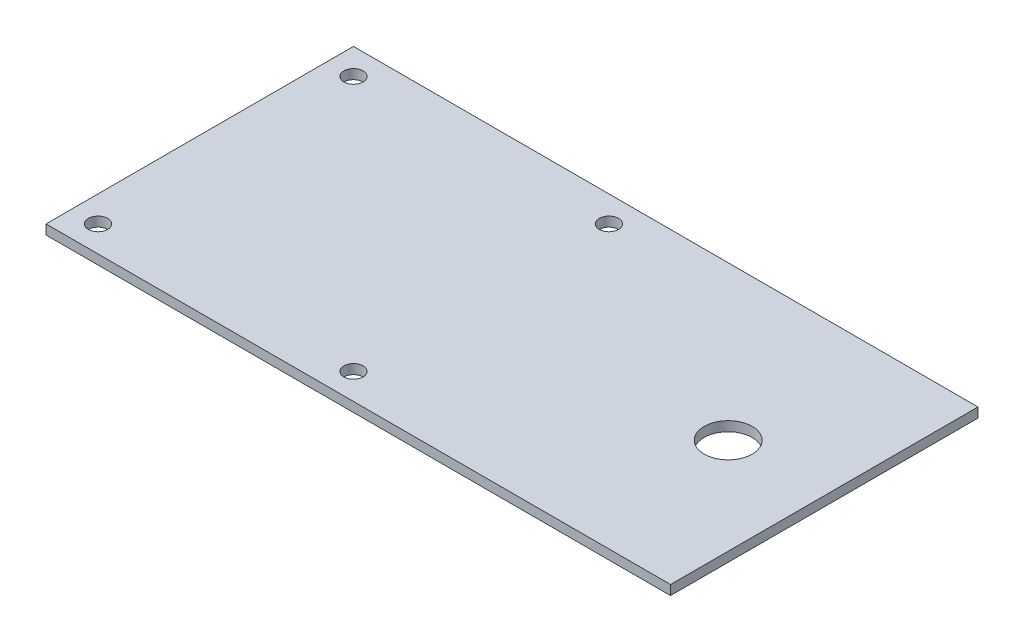
ISO-10303-21;
HEADER;
FILE_DESCRIPTION(('STEP AP214'),'2;1');
FILE_NAME('part.step','',(''),(''),'','','');
FILE_SCHEMA(('AUTOMOTIVE_DESIGN { 1 0 10303 214 1 1 1 1 }'));
ENDSEC;
DATA;
#1=APPLICATION_CONTEXT('core data for automotive mechanical design processes');
#2=APPLICATION_PROTOCOL_DEFINITION('international standard','automotive_design',2000,#1);
#3=PRODUCT_CONTEXT('',#1,'mechanical');
#4=PRODUCT('Part','Part','',(#3));
#5=PRODUCT_RELATED_PRODUCT_CATEGORY('part','',(#4));
#6=PRODUCT_DEFINITION_FORMATION('','',#4);
#7=PRODUCT_DEFINITION_CONTEXT('part definition',#1,'design');
#8=PRODUCT_DEFINITION('design','',#6,#7);
#9=PRODUCT_DEFINITION_SHAPE('','',#8);
#10=(LENGTH_UNIT() NAMED_UNIT(*) SI_UNIT(.MILLI.,.METRE.));
#11=(NAMED_UNIT(*) PLANE_ANGLE_UNIT() SI_UNIT($,.RADIAN.));
#12=(NAMED_UNIT(*) SI_UNIT($,.STERADIAN.) SOLID_ANGLE_UNIT());
#13=UNCERTAINTY_MEASURE_WITH_UNIT(LENGTH_MEASURE(1.E-05),#10,'distance_accuracy_value','');
#14=(GEOMETRIC_REPRESENTATION_CONTEXT(3) GLOBAL_UNCERTAINTY_ASSIGNED_CONTEXT((#13)) GLOBAL_UNIT_ASSIGNED_CONTEXT((#10,
#11,#12)) REPRESENTATION_CONTEXT('',''));
#15=CARTESIAN_POINT('',(0.,0.,0.));
#16=DIRECTION('',(0.,0.,1.));
#17=DIRECTION('',(1.,0.,0.));
#18=AXIS2_PLACEMENT_3D('',#15,#16,#17);
#19=CARTESIAN_POINT('',(0.,10.,0.));
#20=DIRECTION('',(0.,-1.,0.));
#21=DIRECTION('',(0.,0.,-1.));
#22=AXIS2_PLACEMENT_3D('',#19,#20,#21);
#23=PLANE('',#22);
#24=DIRECTION('',(0.,0.,-1.));
#25=VECTOR('',#24,1.);
#26=CARTESIAN_POINT('',(350.,10.,160.));
#27=LINE('',#26,#25);
#28=CARTESIAN_POINT('',(350.,10.,160.));
#29=VERTEX_POINT('',#28);
#30=CARTESIAN_POINT('',(350.,10.,-160.));
#31=VERTEX_POINT('',#30);
#32=EDGE_CURVE('E86',#29,#31,#27,.T.);
#33=ORIENTED_EDGE('',*,*,#32,.T.);
#34=DIRECTION('',(-1.,0.,0.));
#35=VECTOR('',#34,1.);
#36=CARTESIAN_POINT('',(-300.,10.,-160.));
#37=LINE('',#36,#35);
#38=CARTESIAN_POINT('',(-300.,10.,-160.));
#39=VERTEX_POINT('',#38);
#40=EDGE_CURVE('E81',#31,#39,#37,.T.);
#41=ORIENTED_EDGE('',*,*,#40,.T.);
#42=DIRECTION('',(0.,0.,1.));
#43=VECTOR('',#42,1.);
#44=CARTESIAN_POINT('',(-300.,10.,160.));
#45=LINE('',#44,#43);
#46=CARTESIAN_POINT('',(-300.,10.,160.));
#47=VERTEX_POINT('',#46);
#48=EDGE_CURVE('E84',#39,#47,#45,.T.);
#49=ORIENTED_EDGE('',*,*,#48,.T.);
#50=DIRECTION('',(1.,0.,0.));
#51=VECTOR('',#50,1.);
#52=CARTESIAN_POINT('',(-300.,10.,160.));
#53=LINE('',#52,#51);
#54=EDGE_CURVE('E51',#47,#29,#53,.T.);
#55=ORIENTED_EDGE('',*,*,#54,.T.);
#56=EDGE_LOOP('',(#33,#41,#49,#55));
#57=FACE_BOUND('',#56,.T.);
#58=CARTESIAN_POINT('',(-272.936074863071,10.,-132.936074863071));
#59=DIRECTION('',(0.,1.,0.));
#60=DIRECTION('',(0.,0.,1.));
#61=AXIS2_PLACEMENT_3D('',#58,#59,#60);
#62=CIRCLE('',#61,10.);
#63=CARTESIAN_POINT('',(-272.936074863071,10.,-122.936074863071));
#64=VERTEX_POINT('',#63);
#65=EDGE_CURVE('E101',#64,#64,#62,.T.);
#66=ORIENTED_EDGE('',*,*,#65,.F.);
#67=EDGE_LOOP('',(#66));
#68=FACE_BOUND('',#67,.T.);
#69=CARTESIAN_POINT('',(250.,10.,0.));
#70=DIRECTION('',(0.,1.,0.));
#71=DIRECTION('',(0.,0.,1.));
#72=AXIS2_PLACEMENT_3D('',#69,#70,#71);
#73=CIRCLE('',#72,25.);
#74=CARTESIAN_POINT('',(250.,10.,25.));
#75=VERTEX_POINT('',#74);
#76=EDGE_CURVE('E116',#75,#75,#73,.T.);
#77=ORIENTED_EDGE('',*,*,#76,.F.);
#78=EDGE_LOOP('',(#77));
#79=FACE_BOUND('',#78,.T.);
#80=CARTESIAN_POINT('',(-7.06392513692855,10.,-132.936074863074));
#81=DIRECTION('',(0.,1.,0.));
#82=DIRECTION('',(0.,0.,1.));
#83=AXIS2_PLACEMENT_3D('',#80,#81,#82);
#84=CIRCLE('',#83,10.0000000000001);
#85=CARTESIAN_POINT('',(-7.06392513692855,10.,-122.936074863074));
#86=VERTEX_POINT('',#85);
#87=EDGE_CURVE('E122',#86,#86,#84,.T.);
#88=ORIENTED_EDGE('',*,*,#87,.F.);
#89=EDGE_LOOP('',(#88));
#90=FACE_BOUND('',#89,.T.);
#91=CARTESIAN_POINT('',(-7.06392513692627,10.,132.936074863068));
#92=DIRECTION('',(0.,1.,0.));
#93=DIRECTION('',(0.,0.,1.));
#94=AXIS2_PLACEMENT_3D('',#91,#92,#93);
#95=CIRCLE('',#94,10.);
#96=CARTESIAN_POINT('',(-7.06392513692627,10.,142.936074863068));
#97=VERTEX_POINT('',#96);
#98=EDGE_CURVE('E128',#97,#97,#95,.T.);
#99=ORIENTED_EDGE('',*,*,#98,.F.);
#100=EDGE_LOOP('',(#99));
#101=FACE_BOUND('',#100,.T.);
#102=CARTESIAN_POINT('',(-272.936074863069,10.,132.93607486307));
#103=DIRECTION('',(0.,1.,0.));
#104=DIRECTION('',(0.,0.,1.));
#105=AXIS2_PLACEMENT_3D('',#102,#103,#104);
#106=CIRCLE('',#105,10.0000000000001);
#107=CARTESIAN_POINT('',(-272.936074863069,10.,142.93607486307));
#108=VERTEX_POINT('',#107);
#109=EDGE_CURVE('E134',#108,#108,#106,.T.);
#110=ORIENTED_EDGE('',*,*,#109,.F.);
#111=EDGE_LOOP('',(#110));
#112=FACE_BOUND('',#111,.T.);
#113=ADVANCED_FACE('F34',(#57,#68,#79,#90,#101,#112),#23,.F.);
#114=CARTESIAN_POINT('',(0.,0.,0.));
#115=DIRECTION('',(0.,-1.,0.));
#116=DIRECTION('',(0.,0.,-1.));
#117=AXIS2_PLACEMENT_3D('',#114,#115,#116);
#118=PLANE('',#117);
#119=CARTESIAN_POINT('',(-7.06392513692627,0.,132.936074863068));
#120=DIRECTION('',(0.,1.,0.));
#121=DIRECTION('',(0.,0.,1.));
#122=AXIS2_PLACEMENT_3D('',#119,#120,#121);
#123=CIRCLE('',#122,10.);
#124=CARTESIAN_POINT('',(-7.06392513692627,0.,142.936074863068));
#125=VERTEX_POINT('',#124);
#126=EDGE_CURVE('E131',#125,#125,#123,.T.);
#127=ORIENTED_EDGE('',*,*,#126,.T.);
#128=EDGE_LOOP('',(#127));
#129=FACE_BOUND('',#128,.T.);
#130=CARTESIAN_POINT('',(250.,0.,0.));
#131=DIRECTION('',(0.,1.,0.));
#132=DIRECTION('',(0.,0.,1.));
#133=AXIS2_PLACEMENT_3D('',#130,#131,#132);
#134=CIRCLE('',#133,25.);
#135=CARTESIAN_POINT('',(250.,0.,25.));
#136=VERTEX_POINT('',#135);
#137=EDGE_CURVE('E119',#136,#136,#134,.T.);
#138=ORIENTED_EDGE('',*,*,#137,.T.);
#139=EDGE_LOOP('',(#138));
#140=FACE_BOUND('',#139,.T.);
#141=DIRECTION('',(0.,0.,-1.));
#142=VECTOR('',#141,1.);
#143=CARTESIAN_POINT('',(350.,0.,160.));
#144=LINE('',#143,#142);
#145=CARTESIAN_POINT('',(350.,0.,160.));
#146=VERTEX_POINT('',#145);
#147=CARTESIAN_POINT('',(350.,0.,-160.));
#148=VERTEX_POINT('',#147);
#149=EDGE_CURVE('E98',#146,#148,#144,.T.);
#150=ORIENTED_EDGE('',*,*,#149,.F.);
#151=DIRECTION('',(1.,0.,0.));
#152=VECTOR('',#151,1.);
#153=CARTESIAN_POINT('',(-300.,0.,160.));
#154=LINE('',#153,#152);
#155=CARTESIAN_POINT('',(-300.,0.,160.));
#156=VERTEX_POINT('',#155);
#157=EDGE_CURVE('E74',#156,#146,#154,.T.);
#158=ORIENTED_EDGE('',*,*,#157,.F.);
#159=DIRECTION('',(0.,0.,1.));
#160=VECTOR('',#159,1.);
#161=CARTESIAN_POINT('',(-300.,0.,160.));
#162=LINE('',#161,#160);
#163=CARTESIAN_POINT('',(-300.,0.,-160.));
#164=VERTEX_POINT('',#163);
#165=EDGE_CURVE('E68',#164,#156,#162,.T.);
#166=ORIENTED_EDGE('',*,*,#165,.F.);
#167=DIRECTION('',(-1.,0.,0.));
#168=VECTOR('',#167,1.);
#169=CARTESIAN_POINT('',(-300.,0.,-160.));
#170=LINE('',#169,#168);
#171=EDGE_CURVE('E90',#148,#164,#170,.T.);
#172=ORIENTED_EDGE('',*,*,#171,.F.);
#173=EDGE_LOOP('',(#150,#158,#166,#172));
#174=FACE_BOUND('',#173,.T.);
#175=CARTESIAN_POINT('',(-272.936074863071,0.,-132.936074863071));
#176=DIRECTION('',(0.,1.,0.));
#177=DIRECTION('',(0.,0.,1.));
#178=AXIS2_PLACEMENT_3D('',#175,#176,#177);
#179=CIRCLE('',#178,10.);
#180=CARTESIAN_POINT('',(-272.936074863071,0.,-122.936074863071));
#181=VERTEX_POINT('',#180);
#182=EDGE_CURVE('E113',#181,#181,#179,.T.);
#183=ORIENTED_EDGE('',*,*,#182,.T.);
#184=EDGE_LOOP('',(#183));
#185=FACE_BOUND('',#184,.T.);
#186=CARTESIAN_POINT('',(-7.06392513692855,0.,-132.936074863074));
#187=DIRECTION('',(0.,1.,0.));
#188=DIRECTION('',(0.,0.,1.));
#189=AXIS2_PLACEMENT_3D('',#186,#187,#188);
#190=CIRCLE('',#189,10.0000000000001);
#191=CARTESIAN_POINT('',(-7.06392513692855,0.,-122.936074863074));
#192=VERTEX_POINT('',#191);
#193=EDGE_CURVE('E125',#192,#192,#190,.T.);
#194=ORIENTED_EDGE('',*,*,#193,.T.);
#195=EDGE_LOOP('',(#194));
#196=FACE_BOUND('',#195,.T.);
#197=CARTESIAN_POINT('',(-272.936074863069,0.,132.93607486307));
#198=DIRECTION('',(0.,1.,0.));
#199=DIRECTION('',(0.,0.,1.));
#200=AXIS2_PLACEMENT_3D('',#197,#198,#199);
#201=CIRCLE('',#200,10.0000000000001);
#202=CARTESIAN_POINT('',(-272.936074863069,0.,142.93607486307));
#203=VERTEX_POINT('',#202);
#204=EDGE_CURVE('E137',#203,#203,#201,.T.);
#205=ORIENTED_EDGE('',*,*,#204,.T.);
#206=EDGE_LOOP('',(#205));
#207=FACE_BOUND('',#206,.T.);
#208=ADVANCED_FACE('F109',(#129,#140,#174,#185,#196,#207),#118,.T.);
#209=CARTESIAN_POINT('',(350.,10.,160.));
#210=DIRECTION('',(-1.,0.,0.));
#211=DIRECTION('',(0.,0.,1.));
#212=AXIS2_PLACEMENT_3D('',#209,#210,#211);
#213=PLANE('',#212);
#214=ORIENTED_EDGE('',*,*,#149,.T.);
#215=DIRECTION('',(0.,-1.,0.));
#216=VECTOR('',#215,1.);
#217=CARTESIAN_POINT('',(350.,10.,-160.));
#218=LINE('',#217,#216);
#219=EDGE_CURVE('E11',#31,#148,#218,.T.);
#220=ORIENTED_EDGE('',*,*,#219,.F.);
#221=ORIENTED_EDGE('',*,*,#32,.F.);
#222=DIRECTION('',(0.,-1.,0.));
#223=VECTOR('',#222,1.);
#224=CARTESIAN_POINT('',(350.,10.,160.));
#225=LINE('',#224,#223);
#226=EDGE_CURVE('E94',#29,#146,#225,.T.);
#227=ORIENTED_EDGE('',*,*,#226,.T.);
#228=EDGE_LOOP('',(#214,#220,#221,#227));
#229=FACE_BOUND('',#228,.T.);
#230=ADVANCED_FACE('F36',(#229),#213,.F.);
#231=CARTESIAN_POINT('',(-300.,10.,-160.));
#232=DIRECTION('',(0.,0.,1.));
#233=DIRECTION('',(1.,0.,0.));
#234=AXIS2_PLACEMENT_3D('',#231,#232,#233);
#235=PLANE('',#234);
#236=ORIENTED_EDGE('',*,*,#171,.T.);
#237=DIRECTION('',(0.,-1.,0.));
#238=VECTOR('',#237,1.);
#239=CARTESIAN_POINT('',(-300.,10.,-160.));
#240=LINE('',#239,#238);
#241=EDGE_CURVE('E43',#39,#164,#240,.T.);
#242=ORIENTED_EDGE('',*,*,#241,.F.);
#243=ORIENTED_EDGE('',*,*,#40,.F.);
#244=ORIENTED_EDGE('',*,*,#219,.T.);
#245=EDGE_LOOP('',(#236,#242,#243,#244));
#246=FACE_BOUND('',#245,.T.);
#247=ADVANCED_FACE('F89',(#246),#235,.F.);
#248=CARTESIAN_POINT('',(-300.,10.,160.));
#249=DIRECTION('',(1.,0.,0.));
#250=DIRECTION('',(0.,0.,-1.));
#251=AXIS2_PLACEMENT_3D('',#248,#249,#250);
#252=PLANE('',#251);
#253=ORIENTED_EDGE('',*,*,#165,.T.);
#254=DIRECTION('',(0.,-1.,0.));
#255=VECTOR('',#254,1.);
#256=CARTESIAN_POINT('',(-300.,10.,160.));
#257=LINE('',#256,#255);
#258=EDGE_CURVE('E91',#47,#156,#257,.T.);
#259=ORIENTED_EDGE('',*,*,#258,.F.);
#260=ORIENTED_EDGE('',*,*,#48,.F.);
#261=ORIENTED_EDGE('',*,*,#241,.T.);
#262=EDGE_LOOP('',(#253,#259,#260,#261));
#263=FACE_BOUND('',#262,.T.);
#264=ADVANCED_FACE('F92',(#263),#252,.F.);
#265=CARTESIAN_POINT('',(-300.,10.,160.));
#266=DIRECTION('',(0.,0.,-1.));
#267=DIRECTION('',(-1.,0.,0.));
#268=AXIS2_PLACEMENT_3D('',#265,#266,#267);
#269=PLANE('',#268);
#270=ORIENTED_EDGE('',*,*,#157,.T.);
#271=ORIENTED_EDGE('',*,*,#226,.F.);
#272=ORIENTED_EDGE('',*,*,#54,.F.);
#273=ORIENTED_EDGE('',*,*,#258,.T.);
#274=EDGE_LOOP('',(#270,#271,#272,#273));
#275=FACE_BOUND('',#274,.T.);
#276=ADVANCED_FACE('F106',(#275),#269,.F.);
#277=CARTESIAN_POINT('',(-272.936074863071,10.,-132.936074863071));
#278=DIRECTION('',(0.,-1.,0.));
#279=DIRECTION('',(0.,0.,-1.));
#280=AXIS2_PLACEMENT_3D('',#277,#278,#279);
#281=CYLINDRICAL_SURFACE('',#280,10.);
#282=ORIENTED_EDGE('',*,*,#65,.T.);
#283=EDGE_LOOP('',(#282));
#284=FACE_BOUND('',#283,.T.);
#285=ORIENTED_EDGE('',*,*,#182,.F.);
#286=EDGE_LOOP('',(#285));
#287=FACE_BOUND('',#286,.T.);
#288=ADVANCED_FACE('F154',(#284,#287),#281,.F.);
#289=CARTESIAN_POINT('',(250.,10.,0.));
#290=DIRECTION('',(0.,-1.,0.));
#291=DIRECTION('',(0.,0.,-1.));
#292=AXIS2_PLACEMENT_3D('',#289,#290,#291);
#293=CYLINDRICAL_SURFACE('',#292,25.);
#294=ORIENTED_EDGE('',*,*,#76,.T.);
#295=EDGE_LOOP('',(#294));
#296=FACE_BOUND('',#295,.T.);
#297=ORIENTED_EDGE('',*,*,#137,.F.);
#298=EDGE_LOOP('',(#297));
#299=FACE_BOUND('',#298,.T.);
#300=ADVANCED_FACE('F200',(#296,#299),#293,.F.);
#301=CARTESIAN_POINT('',(-7.06392513692855,10.,-132.936074863074));
#302=DIRECTION('',(0.,-1.,0.));
#303=DIRECTION('',(0.,0.,-1.));
#304=AXIS2_PLACEMENT_3D('',#301,#302,#303);
#305=CYLINDRICAL_SURFACE('',#304,10.0000000000001);
#306=ORIENTED_EDGE('',*,*,#87,.T.);
#307=EDGE_LOOP('',(#306));
#308=FACE_BOUND('',#307,.T.);
#309=ORIENTED_EDGE('',*,*,#193,.F.);
#310=EDGE_LOOP('',(#309));
#311=FACE_BOUND('',#310,.T.);
#312=ADVANCED_FACE('F208',(#308,#311),#305,.F.);
#313=CARTESIAN_POINT('',(-7.06392513692627,10.,132.936074863068));
#314=DIRECTION('',(0.,-1.,0.));
#315=DIRECTION('',(0.,0.,-1.));
#316=AXIS2_PLACEMENT_3D('',#313,#314,#315);
#317=CYLINDRICAL_SURFACE('',#316,10.);
#318=ORIENTED_EDGE('',*,*,#98,.T.);
#319=EDGE_LOOP('',(#318));
#320=FACE_BOUND('',#319,.T.);
#321=ORIENTED_EDGE('',*,*,#126,.F.);
#322=EDGE_LOOP('',(#321));
#323=FACE_BOUND('',#322,.T.);
#324=ADVANCED_FACE('F216',(#320,#323),#317,.F.);
#325=CARTESIAN_POINT('',(-272.936074863069,10.,132.93607486307));
#326=DIRECTION('',(0.,-1.,0.));
#327=DIRECTION('',(0.,0.,-1.));
#328=AXIS2_PLACEMENT_3D('',#325,#326,#327);
#329=CYLINDRICAL_SURFACE('',#328,10.0000000000001);
#330=ORIENTED_EDGE('',*,*,#109,.T.);
#331=EDGE_LOOP('',(#330));
#332=FACE_BOUND('',#331,.T.);
#333=ORIENTED_EDGE('',*,*,#204,.F.);
#334=EDGE_LOOP('',(#333));
#335=FACE_BOUND('',#334,.T.);
#336=ADVANCED_FACE('F143',(#332,#335),#329,.F.);
#337=CLOSED_SHELL('',(#113,#208,#230,#247,#264,#276,#288,#300,#312,#324,#336));
#338=MANIFOLD_SOLID_BREP('B2',#337);
#339=ADVANCED_BREP_SHAPE_REPRESENTATION('',(#18,#338),#14);
#340=SHAPE_DEFINITION_REPRESENTATION(#9,#339);
ENDSEC;
END-ISO-10303-21;
